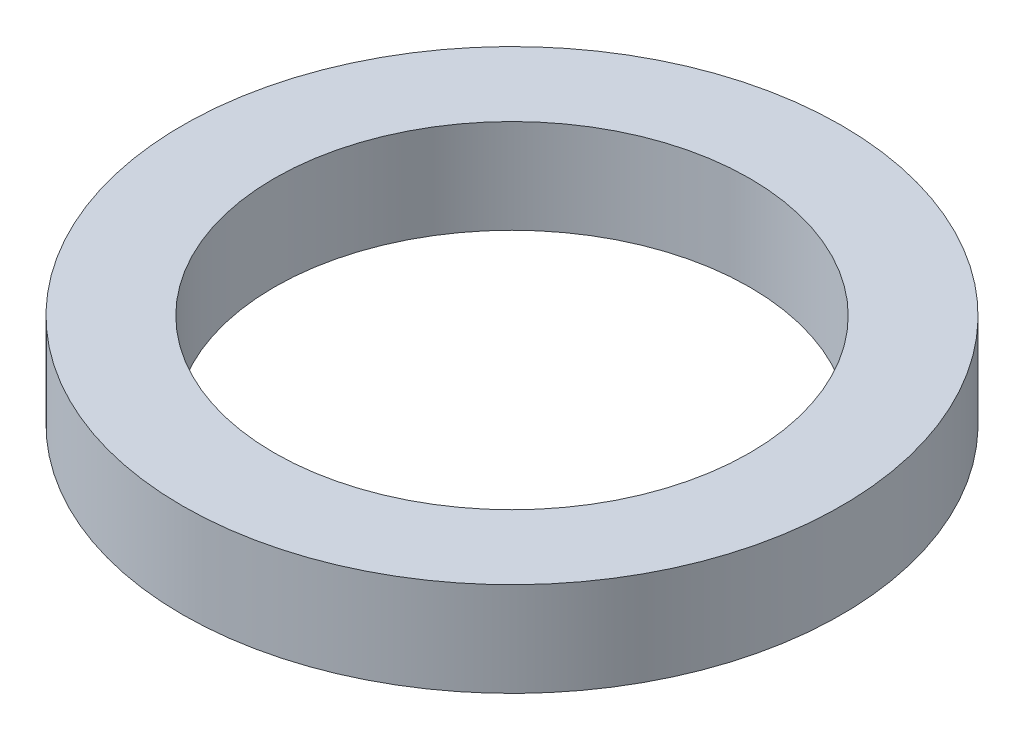
ISO-10303-21;
HEADER;
FILE_DESCRIPTION(('STEP AP214'),'2;1');
FILE_NAME('part.step','',(''),(''),'','','');
FILE_SCHEMA(('AUTOMOTIVE_DESIGN { 1 0 10303 214 1 1 1 1 }'));
ENDSEC;
DATA;
#1=APPLICATION_CONTEXT('core data for automotive mechanical design processes');
#2=APPLICATION_PROTOCOL_DEFINITION('international standard','automotive_design',2000,#1);
#3=PRODUCT_CONTEXT('',#1,'mechanical');
#4=PRODUCT('Part','Part','',(#3));
#5=PRODUCT_RELATED_PRODUCT_CATEGORY('part','',(#4));
#6=PRODUCT_DEFINITION_FORMATION('','',#4);
#7=PRODUCT_DEFINITION_CONTEXT('part definition',#1,'design');
#8=PRODUCT_DEFINITION('design','',#6,#7);
#9=PRODUCT_DEFINITION_SHAPE('','',#8);
#10=(LENGTH_UNIT() NAMED_UNIT(*) SI_UNIT(.MILLI.,.METRE.));
#11=(NAMED_UNIT(*) PLANE_ANGLE_UNIT() SI_UNIT($,.RADIAN.));
#12=(NAMED_UNIT(*) SI_UNIT($,.STERADIAN.) SOLID_ANGLE_UNIT());
#13=UNCERTAINTY_MEASURE_WITH_UNIT(LENGTH_MEASURE(1.E-05),#10,'distance_accuracy_value','');
#14=(GEOMETRIC_REPRESENTATION_CONTEXT(3) GLOBAL_UNCERTAINTY_ASSIGNED_CONTEXT((#13)) GLOBAL_UNIT_ASSIGNED_CONTEXT((#10,
#11,#12)) REPRESENTATION_CONTEXT('',''));
#15=CARTESIAN_POINT('',(0.,0.,0.));
#16=DIRECTION('',(0.,0.,1.));
#17=DIRECTION('',(1.,0.,0.));
#18=AXIS2_PLACEMENT_3D('',#15,#16,#17);
#19=CARTESIAN_POINT('',(0.,1.,0.));
#20=DIRECTION('',(0.,1.,0.));
#21=DIRECTION('',(0.,0.,1.));
#22=AXIS2_PLACEMENT_3D('',#19,#20,#21);
#23=PLANE('',#22);
#24=CARTESIAN_POINT('',(0.,1.,0.));
#25=DIRECTION('',(0.,1.,0.));
#26=DIRECTION('',(0.,0.,1.));
#27=AXIS2_PLACEMENT_3D('',#24,#25,#26);
#28=CIRCLE('',#27,3.5);
#29=CARTESIAN_POINT('',(0.,1.,3.5));
#30=VERTEX_POINT('',#29);
#31=EDGE_CURVE('E12',#30,#30,#28,.T.);
#32=ORIENTED_EDGE('',*,*,#31,.T.);
#33=EDGE_LOOP('',(#32));
#34=FACE_BOUND('',#33,.T.);
#35=CARTESIAN_POINT('',(0.,1.,0.));
#36=DIRECTION('',(0.,1.,0.));
#37=DIRECTION('',(0.,0.,1.));
#38=AXIS2_PLACEMENT_3D('',#35,#36,#37);
#39=CIRCLE('',#38,2.525);
#40=CARTESIAN_POINT('',(0.,1.,2.525));
#41=VERTEX_POINT('',#40);
#42=EDGE_CURVE('E51',#41,#41,#39,.T.);
#43=ORIENTED_EDGE('',*,*,#42,.F.);
#44=EDGE_LOOP('',(#43));
#45=FACE_BOUND('',#44,.T.);
#46=ADVANCED_FACE('F40',(#34,#45),#23,.T.);
#47=CARTESIAN_POINT('',(0.,0.,0.));
#48=DIRECTION('',(0.,1.,0.));
#49=DIRECTION('',(0.,0.,1.));
#50=AXIS2_PLACEMENT_3D('',#47,#48,#49);
#51=PLANE('',#50);
#52=CARTESIAN_POINT('',(0.,0.,0.));
#53=DIRECTION('',(0.,1.,0.));
#54=DIRECTION('',(0.,0.,1.));
#55=AXIS2_PLACEMENT_3D('',#52,#53,#54);
#56=CIRCLE('',#55,3.5);
#57=CARTESIAN_POINT('',(0.,0.,3.5));
#58=VERTEX_POINT('',#57);
#59=EDGE_CURVE('E44',#58,#58,#56,.T.);
#60=ORIENTED_EDGE('',*,*,#59,.F.);
#61=EDGE_LOOP('',(#60));
#62=FACE_BOUND('',#61,.T.);
#63=CARTESIAN_POINT('',(0.,0.,0.));
#64=DIRECTION('',(0.,1.,0.));
#65=DIRECTION('',(0.,0.,1.));
#66=AXIS2_PLACEMENT_3D('',#63,#64,#65);
#67=CIRCLE('',#66,2.525);
#68=CARTESIAN_POINT('',(0.,0.,2.525));
#69=VERTEX_POINT('',#68);
#70=EDGE_CURVE('E53',#69,#69,#67,.T.);
#71=ORIENTED_EDGE('',*,*,#70,.T.);
#72=EDGE_LOOP('',(#71));
#73=FACE_BOUND('',#72,.T.);
#74=ADVANCED_FACE('F63',(#62,#73),#51,.F.);
#75=CARTESIAN_POINT('',(0.,1.,0.));
#76=DIRECTION('',(0.,-1.,0.));
#77=DIRECTION('',(0.,0.,-1.));
#78=AXIS2_PLACEMENT_3D('',#75,#76,#77);
#79=CYLINDRICAL_SURFACE('',#78,3.5);
#80=ORIENTED_EDGE('',*,*,#31,.F.);
#81=EDGE_LOOP('',(#80));
#82=FACE_BOUND('',#81,.T.);
#83=ORIENTED_EDGE('',*,*,#59,.T.);
#84=EDGE_LOOP('',(#83));
#85=FACE_BOUND('',#84,.T.);
#86=ADVANCED_FACE('F42',(#82,#85),#79,.T.);
#87=CARTESIAN_POINT('',(0.,1.,0.));
#88=DIRECTION('',(0.,-1.,0.));
#89=DIRECTION('',(0.,0.,-1.));
#90=AXIS2_PLACEMENT_3D('',#87,#88,#89);
#91=CYLINDRICAL_SURFACE('',#90,2.525);
#92=ORIENTED_EDGE('',*,*,#42,.T.);
#93=EDGE_LOOP('',(#92));
#94=FACE_BOUND('',#93,.T.);
#95=ORIENTED_EDGE('',*,*,#70,.F.);
#96=EDGE_LOOP('',(#95));
#97=FACE_BOUND('',#96,.T.);
#98=ADVANCED_FACE('F59',(#94,#97),#91,.F.);
#99=CLOSED_SHELL('',(#46,#74,#86,#98));
#100=MANIFOLD_SOLID_BREP('B2',#99);
#101=ADVANCED_BREP_SHAPE_REPRESENTATION('',(#18,#100),#14);
#102=SHAPE_DEFINITION_REPRESENTATION(#9,#101);
ENDSEC;
END-ISO-10303-21;
